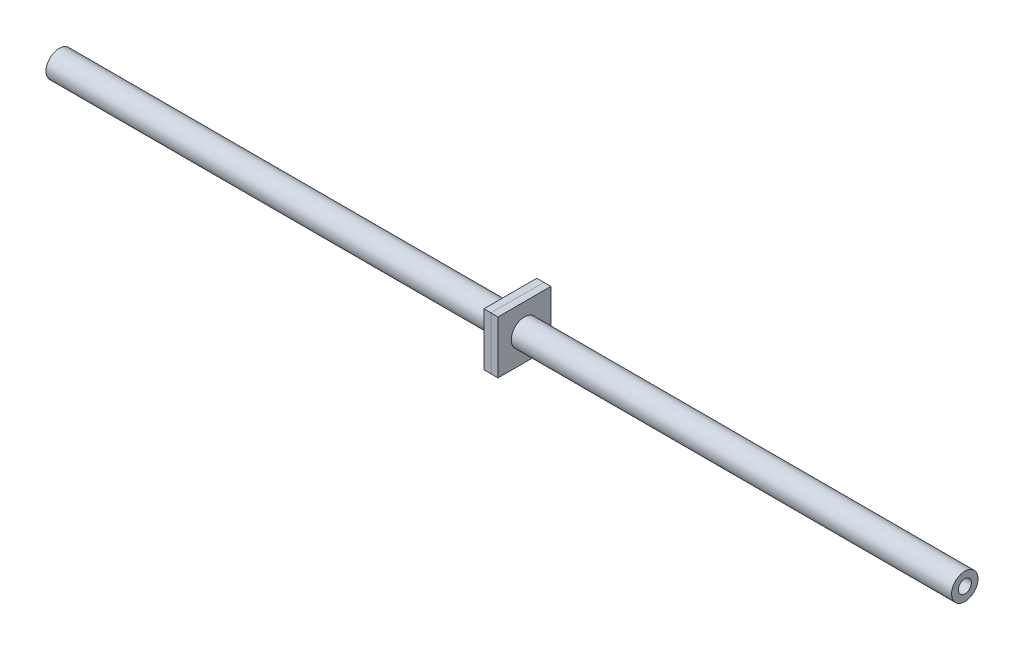
ISO-10303-21;
HEADER;
FILE_DESCRIPTION(('STEP AP214'),'2;1');
FILE_NAME('part.step','',(''),(''),'','','');
FILE_SCHEMA(('AUTOMOTIVE_DESIGN { 1 0 10303 214 1 1 1 1 }'));
ENDSEC;
DATA;
#1=APPLICATION_CONTEXT('core data for automotive mechanical design processes');
#2=APPLICATION_PROTOCOL_DEFINITION('international standard','automotive_design',2000,#1);
#3=PRODUCT_CONTEXT('',#1,'mechanical');
#4=PRODUCT('Part','Part','',(#3));
#5=PRODUCT_RELATED_PRODUCT_CATEGORY('part','',(#4));
#6=PRODUCT_DEFINITION_FORMATION('','',#4);
#7=PRODUCT_DEFINITION_CONTEXT('part definition',#1,'design');
#8=PRODUCT_DEFINITION('design','',#6,#7);
#9=PRODUCT_DEFINITION_SHAPE('','',#8);
#10=(LENGTH_UNIT() NAMED_UNIT(*) SI_UNIT(.MILLI.,.METRE.));
#11=(NAMED_UNIT(*) PLANE_ANGLE_UNIT() SI_UNIT($,.RADIAN.));
#12=(NAMED_UNIT(*) SI_UNIT($,.STERADIAN.) SOLID_ANGLE_UNIT());
#13=UNCERTAINTY_MEASURE_WITH_UNIT(LENGTH_MEASURE(1.E-05),#10,'distance_accuracy_value','');
#14=(GEOMETRIC_REPRESENTATION_CONTEXT(3) GLOBAL_UNCERTAINTY_ASSIGNED_CONTEXT((#13)) GLOBAL_UNIT_ASSIGNED_CONTEXT((#10,
#11,#12)) REPRESENTATION_CONTEXT('',''));
#15=CARTESIAN_POINT('',(0.,0.,0.));
#16=DIRECTION('',(0.,0.,1.));
#17=DIRECTION('',(1.,0.,0.));
#18=AXIS2_PLACEMENT_3D('',#15,#16,#17);
#19=CARTESIAN_POINT('',(162.56,0.,0.));
#20=DIRECTION('',(1.,0.,0.));
#21=DIRECTION('',(0.,0.,-1.));
#22=AXIS2_PLACEMENT_3D('',#19,#20,#21);
#23=PLANE('',#22);
#24=DIRECTION('',(0.,1.,0.));
#25=VECTOR('',#24,1.);
#26=CARTESIAN_POINT('',(162.56,0.,-9.525));
#27=LINE('',#26,#25);
#28=CARTESIAN_POINT('',(162.56,-9.525,-9.525));
#29=VERTEX_POINT('',#28);
#30=CARTESIAN_POINT('',(162.56,9.525,-9.525));
#31=VERTEX_POINT('',#30);
#32=EDGE_CURVE('E113',#29,#31,#27,.T.);
#33=ORIENTED_EDGE('',*,*,#32,.F.);
#34=DIRECTION('',(0.,0.,-1.));
#35=VECTOR('',#34,1.);
#36=CARTESIAN_POINT('',(162.56,-9.525,0.));
#37=LINE('',#36,#35);
#38=CARTESIAN_POINT('',(162.56,-9.525,9.525));
#39=VERTEX_POINT('',#38);
#40=EDGE_CURVE('E110',#39,#29,#37,.T.);
#41=ORIENTED_EDGE('',*,*,#40,.F.);
#42=DIRECTION('',(0.,-1.,0.));
#43=VECTOR('',#42,1.);
#44=CARTESIAN_POINT('',(162.56,0.,9.525));
#45=LINE('',#44,#43);
#46=CARTESIAN_POINT('',(162.56,9.525,9.525));
#47=VERTEX_POINT('',#46);
#48=EDGE_CURVE('E103',#47,#39,#45,.T.);
#49=ORIENTED_EDGE('',*,*,#48,.F.);
#50=DIRECTION('',(0.,0.,1.));
#51=VECTOR('',#50,1.);
#52=CARTESIAN_POINT('',(162.56,9.525,0.));
#53=LINE('',#52,#51);
#54=EDGE_CURVE('E109',#31,#47,#53,.T.);
#55=ORIENTED_EDGE('',*,*,#54,.F.);
#56=EDGE_LOOP('',(#33,#41,#49,#55));
#57=FACE_BOUND('',#56,.T.);
#58=CARTESIAN_POINT('',(162.56,0.,0.));
#59=DIRECTION('',(-1.,0.,0.));
#60=DIRECTION('',(0.,0.,1.));
#61=AXIS2_PLACEMENT_3D('',#58,#59,#60);
#62=CIRCLE('',#61,4.7625);
#63=CARTESIAN_POINT('',(162.56,0.,4.7625));
#64=VERTEX_POINT('',#63);
#65=EDGE_CURVE('E124',#64,#64,#62,.T.);
#66=ORIENTED_EDGE('',*,*,#65,.F.);
#67=EDGE_LOOP('',(#66));
#68=FACE_BOUND('',#67,.T.);
#69=ADVANCED_FACE('F54',(#57,#68),#23,.F.);
#70=CARTESIAN_POINT('',(165.1,0.,0.));
#71=DIRECTION('',(1.,0.,0.));
#72=DIRECTION('',(0.,0.,-1.));
#73=AXIS2_PLACEMENT_3D('',#70,#71,#72);
#74=PLANE('',#73);
#75=DIRECTION('',(0.,1.,0.));
#76=VECTOR('',#75,1.);
#77=CARTESIAN_POINT('',(165.1,0.,-9.525));
#78=LINE('',#77,#76);
#79=CARTESIAN_POINT('',(165.1,-9.525,-9.525));
#80=VERTEX_POINT('',#79);
#81=CARTESIAN_POINT('',(165.1,9.525,-9.525));
#82=VERTEX_POINT('',#81);
#83=EDGE_CURVE('E120',#80,#82,#78,.T.);
#84=ORIENTED_EDGE('',*,*,#83,.T.);
#85=DIRECTION('',(0.,0.,1.));
#86=VECTOR('',#85,1.);
#87=CARTESIAN_POINT('',(165.1,9.525,0.));
#88=LINE('',#87,#86);
#89=CARTESIAN_POINT('',(165.1,9.525,9.525));
#90=VERTEX_POINT('',#89);
#91=EDGE_CURVE('E123',#82,#90,#88,.T.);
#92=ORIENTED_EDGE('',*,*,#91,.T.);
#93=DIRECTION('',(0.,-1.,0.));
#94=VECTOR('',#93,1.);
#95=CARTESIAN_POINT('',(165.1,0.,9.525));
#96=LINE('',#95,#94);
#97=CARTESIAN_POINT('',(165.1,-9.525,9.525));
#98=VERTEX_POINT('',#97);
#99=EDGE_CURVE('E105',#90,#98,#96,.T.);
#100=ORIENTED_EDGE('',*,*,#99,.T.);
#101=DIRECTION('',(0.,0.,-1.));
#102=VECTOR('',#101,1.);
#103=CARTESIAN_POINT('',(165.1,-9.525,0.));
#104=LINE('',#103,#102);
#105=EDGE_CURVE('E115',#98,#80,#104,.T.);
#106=ORIENTED_EDGE('',*,*,#105,.T.);
#107=EDGE_LOOP('',(#84,#92,#100,#106));
#108=FACE_BOUND('',#107,.T.);
#109=CARTESIAN_POINT('',(165.1,0.,0.));
#110=DIRECTION('',(-1.,0.,0.));
#111=DIRECTION('',(0.,0.,1.));
#112=AXIS2_PLACEMENT_3D('',#109,#110,#111);
#113=CIRCLE('',#112,4.7625);
#114=CARTESIAN_POINT('',(165.1,0.,4.7625));
#115=VERTEX_POINT('',#114);
#116=EDGE_CURVE('E158',#115,#115,#113,.T.);
#117=ORIENTED_EDGE('',*,*,#116,.T.);
#118=EDGE_LOOP('',(#117));
#119=FACE_BOUND('',#118,.T.);
#120=ADVANCED_FACE('F130',(#108,#119),#74,.T.);
#121=CARTESIAN_POINT('',(162.56,0.,-9.525));
#122=DIRECTION('',(0.,0.,-1.));
#123=DIRECTION('',(0.,1.,0.));
#124=AXIS2_PLACEMENT_3D('',#121,#122,#123);
#125=PLANE('',#124);
#126=ORIENTED_EDGE('',*,*,#83,.F.);
#127=DIRECTION('',(1.,0.,0.));
#128=VECTOR('',#127,1.);
#129=CARTESIAN_POINT('',(162.56,-9.525,-9.525));
#130=LINE('',#129,#128);
#131=EDGE_CURVE('E13',#29,#80,#130,.T.);
#132=ORIENTED_EDGE('',*,*,#131,.F.);
#133=ORIENTED_EDGE('',*,*,#32,.T.);
#134=DIRECTION('',(1.,0.,0.));
#135=VECTOR('',#134,1.);
#136=CARTESIAN_POINT('',(162.56,9.525,-9.525));
#137=LINE('',#136,#135);
#138=EDGE_CURVE('E58',#31,#82,#137,.T.);
#139=ORIENTED_EDGE('',*,*,#138,.T.);
#140=EDGE_LOOP('',(#126,#132,#133,#139));
#141=FACE_BOUND('',#140,.T.);
#142=ADVANCED_FACE('F56',(#141),#125,.T.);
#143=CARTESIAN_POINT('',(162.56,-9.525,0.));
#144=DIRECTION('',(0.,-1.,0.));
#145=DIRECTION('',(0.,0.,-1.));
#146=AXIS2_PLACEMENT_3D('',#143,#144,#145);
#147=PLANE('',#146);
#148=ORIENTED_EDGE('',*,*,#105,.F.);
#149=DIRECTION('',(1.,0.,0.));
#150=VECTOR('',#149,1.);
#151=CARTESIAN_POINT('',(162.56,-9.525,9.525));
#152=LINE('',#151,#150);
#153=EDGE_CURVE('E64',#39,#98,#152,.T.);
#154=ORIENTED_EDGE('',*,*,#153,.F.);
#155=ORIENTED_EDGE('',*,*,#40,.T.);
#156=ORIENTED_EDGE('',*,*,#131,.T.);
#157=EDGE_LOOP('',(#148,#154,#155,#156));
#158=FACE_BOUND('',#157,.T.);
#159=ADVANCED_FACE('F132',(#158),#147,.T.);
#160=CARTESIAN_POINT('',(162.56,0.,9.525));
#161=DIRECTION('',(0.,0.,1.));
#162=DIRECTION('',(0.,-1.,0.));
#163=AXIS2_PLACEMENT_3D('',#160,#161,#162);
#164=PLANE('',#163);
#165=ORIENTED_EDGE('',*,*,#99,.F.);
#166=DIRECTION('',(1.,0.,0.));
#167=VECTOR('',#166,1.);
#168=CARTESIAN_POINT('',(162.56,9.525,9.525));
#169=LINE('',#168,#167);
#170=EDGE_CURVE('E100',#47,#90,#169,.T.);
#171=ORIENTED_EDGE('',*,*,#170,.F.);
#172=ORIENTED_EDGE('',*,*,#48,.T.);
#173=ORIENTED_EDGE('',*,*,#153,.T.);
#174=EDGE_LOOP('',(#165,#171,#172,#173));
#175=FACE_BOUND('',#174,.T.);
#176=ADVANCED_FACE('F102',(#175),#164,.T.);
#177=CARTESIAN_POINT('',(162.56,9.525,0.));
#178=DIRECTION('',(0.,1.,0.));
#179=DIRECTION('',(0.,0.,1.));
#180=AXIS2_PLACEMENT_3D('',#177,#178,#179);
#181=PLANE('',#180);
#182=ORIENTED_EDGE('',*,*,#91,.F.);
#183=ORIENTED_EDGE('',*,*,#138,.F.);
#184=ORIENTED_EDGE('',*,*,#54,.T.);
#185=ORIENTED_EDGE('',*,*,#170,.T.);
#186=EDGE_LOOP('',(#182,#183,#184,#185));
#187=FACE_BOUND('',#186,.T.);
#188=ADVANCED_FACE('F112',(#187),#181,.T.);
#189=CARTESIAN_POINT('',(162.56,0.,0.));
#190=DIRECTION('',(1.,0.,0.));
#191=DIRECTION('',(0.,0.,-1.));
#192=AXIS2_PLACEMENT_3D('',#189,#190,#191);
#193=CYLINDRICAL_SURFACE('',#192,4.7625);
#194=ORIENTED_EDGE('',*,*,#65,.T.);
#195=EDGE_LOOP('',(#194));
#196=FACE_BOUND('',#195,.T.);
#197=ORIENTED_EDGE('',*,*,#116,.F.);
#198=EDGE_LOOP('',(#197));
#199=FACE_BOUND('',#198,.T.);
#200=ADVANCED_FACE('F147',(#196,#199),#193,.F.);
#201=CLOSED_SHELL('',(#69,#120,#142,#159,#176,#188,#200));
#202=MANIFOLD_SOLID_BREP('B2',#201);
#203=CARTESIAN_POINT('',(167.64,0.,0.));
#204=DIRECTION('',(-1.,0.,0.));
#205=DIRECTION('',(0.,0.,1.));
#206=AXIS2_PLACEMENT_3D('',#203,#204,#205);
#207=PLANE('',#206);
#208=DIRECTION('',(0.,-1.,0.));
#209=VECTOR('',#208,1.);
#210=CARTESIAN_POINT('',(167.64,9.525,9.52500000000001));
#211=LINE('',#210,#209);
#212=CARTESIAN_POINT('',(167.64,9.525,9.52500000000001));
#213=VERTEX_POINT('',#212);
#214=CARTESIAN_POINT('',(167.64,-9.525,9.525));
#215=VERTEX_POINT('',#214);
#216=EDGE_CURVE('E257',#213,#215,#211,.T.);
#217=ORIENTED_EDGE('',*,*,#216,.T.);
#218=DIRECTION('',(0.,0.,-1.));
#219=VECTOR('',#218,1.);
#220=CARTESIAN_POINT('',(167.64,-9.525,-9.525));
#221=LINE('',#220,#219);
#222=CARTESIAN_POINT('',(167.64,-9.525,-9.525));
#223=VERTEX_POINT('',#222);
#224=EDGE_CURVE('E252',#215,#223,#221,.T.);
#225=ORIENTED_EDGE('',*,*,#224,.T.);
#226=DIRECTION('',(0.,1.,0.));
#227=VECTOR('',#226,1.);
#228=CARTESIAN_POINT('',(167.64,9.525,-9.525));
#229=LINE('',#228,#227);
#230=CARTESIAN_POINT('',(167.64,9.525,-9.525));
#231=VERTEX_POINT('',#230);
#232=EDGE_CURVE('E255',#223,#231,#229,.T.);
#233=ORIENTED_EDGE('',*,*,#232,.T.);
#234=DIRECTION('',(0.,0.,1.));
#235=VECTOR('',#234,1.);
#236=CARTESIAN_POINT('',(167.64,9.525,-9.525));
#237=LINE('',#236,#235);
#238=EDGE_CURVE('E222',#231,#213,#237,.T.);
#239=ORIENTED_EDGE('',*,*,#238,.T.);
#240=EDGE_LOOP('',(#217,#225,#233,#239));
#241=FACE_BOUND('',#240,.T.);
#242=CARTESIAN_POINT('',(167.64,0.,0.));
#243=DIRECTION('',(1.,0.,0.));
#244=DIRECTION('',(0.,0.,-1.));
#245=AXIS2_PLACEMENT_3D('',#242,#243,#244);
#246=CIRCLE('',#245,4.7625);
#247=CARTESIAN_POINT('',(167.64,0.,-4.7625));
#248=VERTEX_POINT('',#247);
#249=EDGE_CURVE('E272',#248,#248,#246,.T.);
#250=ORIENTED_EDGE('',*,*,#249,.F.);
#251=EDGE_LOOP('',(#250));
#252=FACE_BOUND('',#251,.T.);
#253=ADVANCED_FACE('F205',(#241,#252),#207,.F.);
#254=CARTESIAN_POINT('',(165.1,0.,0.));
#255=DIRECTION('',(-1.,0.,0.));
#256=DIRECTION('',(0.,0.,1.));
#257=AXIS2_PLACEMENT_3D('',#254,#255,#256);
#258=PLANE('',#257);
#259=DIRECTION('',(0.,-1.,0.));
#260=VECTOR('',#259,1.);
#261=CARTESIAN_POINT('',(165.1,9.525,9.52500000000001));
#262=LINE('',#261,#260);
#263=CARTESIAN_POINT('',(165.1,9.525,9.52500000000001));
#264=VERTEX_POINT('',#263);
#265=CARTESIAN_POINT('',(165.1,-9.525,9.525));
#266=VERTEX_POINT('',#265);
#267=EDGE_CURVE('E269',#264,#266,#262,.T.);
#268=ORIENTED_EDGE('',*,*,#267,.F.);
#269=DIRECTION('',(0.,0.,1.));
#270=VECTOR('',#269,1.);
#271=CARTESIAN_POINT('',(165.1,9.525,-9.525));
#272=LINE('',#271,#270);
#273=CARTESIAN_POINT('',(165.1,9.525,-9.525));
#274=VERTEX_POINT('',#273);
#275=EDGE_CURVE('E245',#274,#264,#272,.T.);
#276=ORIENTED_EDGE('',*,*,#275,.F.);
#277=DIRECTION('',(0.,1.,0.));
#278=VECTOR('',#277,1.);
#279=CARTESIAN_POINT('',(165.1,9.525,-9.525));
#280=LINE('',#279,#278);
#281=CARTESIAN_POINT('',(165.1,-9.525,-9.525));
#282=VERTEX_POINT('',#281);
#283=EDGE_CURVE('E239',#282,#274,#280,.T.);
#284=ORIENTED_EDGE('',*,*,#283,.F.);
#285=DIRECTION('',(0.,0.,-1.));
#286=VECTOR('',#285,1.);
#287=CARTESIAN_POINT('',(165.1,-9.525,-9.525));
#288=LINE('',#287,#286);
#289=EDGE_CURVE('E261',#266,#282,#288,.T.);
#290=ORIENTED_EDGE('',*,*,#289,.F.);
#291=EDGE_LOOP('',(#268,#276,#284,#290));
#292=FACE_BOUND('',#291,.T.);
#293=CARTESIAN_POINT('',(165.1,0.,0.));
#294=DIRECTION('',(1.,0.,0.));
#295=DIRECTION('',(0.,0.,-1.));
#296=AXIS2_PLACEMENT_3D('',#293,#294,#295);
#297=CIRCLE('',#296,4.7625);
#298=CARTESIAN_POINT('',(165.1,0.,-4.7625));
#299=VERTEX_POINT('',#298);
#300=EDGE_CURVE('E284',#299,#299,#297,.T.);
#301=ORIENTED_EDGE('',*,*,#300,.T.);
#302=EDGE_LOOP('',(#301));
#303=FACE_BOUND('',#302,.T.);
#304=ADVANCED_FACE('F280',(#292,#303),#258,.T.);
#305=CARTESIAN_POINT('',(167.64,9.525,9.52500000000001));
#306=DIRECTION('',(0.,0.,-1.));
#307=DIRECTION('',(0.,1.,0.));
#308=AXIS2_PLACEMENT_3D('',#305,#306,#307);
#309=PLANE('',#308);
#310=ORIENTED_EDGE('',*,*,#267,.T.);
#311=DIRECTION('',(-1.,0.,0.));
#312=VECTOR('',#311,1.);
#313=CARTESIAN_POINT('',(167.64,-9.525,9.525));
#314=LINE('',#313,#312);
#315=EDGE_CURVE('E52',#215,#266,#314,.T.);
#316=ORIENTED_EDGE('',*,*,#315,.F.);
#317=ORIENTED_EDGE('',*,*,#216,.F.);
#318=DIRECTION('',(-1.,0.,0.));
#319=VECTOR('',#318,1.);
#320=CARTESIAN_POINT('',(167.64,9.525,9.52500000000001));
#321=LINE('',#320,#319);
#322=EDGE_CURVE('E265',#213,#264,#321,.T.);
#323=ORIENTED_EDGE('',*,*,#322,.T.);
#324=EDGE_LOOP('',(#310,#316,#317,#323));
#325=FACE_BOUND('',#324,.T.);
#326=ADVANCED_FACE('F207',(#325),#309,.F.);
#327=CARTESIAN_POINT('',(167.64,-9.525,-9.525));
#328=DIRECTION('',(0.,1.,0.));
#329=DIRECTION('',(0.,0.,1.));
#330=AXIS2_PLACEMENT_3D('',#327,#328,#329);
#331=PLANE('',#330);
#332=ORIENTED_EDGE('',*,*,#289,.T.);
#333=DIRECTION('',(-1.,0.,0.));
#334=VECTOR('',#333,1.);
#335=CARTESIAN_POINT('',(167.64,-9.525,-9.525));
#336=LINE('',#335,#334);
#337=EDGE_CURVE('E214',#223,#282,#336,.T.);
#338=ORIENTED_EDGE('',*,*,#337,.F.);
#339=ORIENTED_EDGE('',*,*,#224,.F.);
#340=ORIENTED_EDGE('',*,*,#315,.T.);
#341=EDGE_LOOP('',(#332,#338,#339,#340));
#342=FACE_BOUND('',#341,.T.);
#343=ADVANCED_FACE('F260',(#342),#331,.F.);
#344=CARTESIAN_POINT('',(167.64,9.525,-9.525));
#345=DIRECTION('',(0.,0.,1.));
#346=DIRECTION('',(0.,-1.,0.));
#347=AXIS2_PLACEMENT_3D('',#344,#345,#346);
#348=PLANE('',#347);
#349=ORIENTED_EDGE('',*,*,#283,.T.);
#350=DIRECTION('',(-1.,0.,0.));
#351=VECTOR('',#350,1.);
#352=CARTESIAN_POINT('',(167.64,9.525,-9.525));
#353=LINE('',#352,#351);
#354=EDGE_CURVE('E262',#231,#274,#353,.T.);
#355=ORIENTED_EDGE('',*,*,#354,.F.);
#356=ORIENTED_EDGE('',*,*,#232,.F.);
#357=ORIENTED_EDGE('',*,*,#337,.T.);
#358=EDGE_LOOP('',(#349,#355,#356,#357));
#359=FACE_BOUND('',#358,.T.);
#360=ADVANCED_FACE('F263',(#359),#348,.F.);
#361=CARTESIAN_POINT('',(167.64,9.525,-9.525));
#362=DIRECTION('',(0.,-1.,0.));
#363=DIRECTION('',(0.,0.,-1.));
#364=AXIS2_PLACEMENT_3D('',#361,#362,#363);
#365=PLANE('',#364);
#366=ORIENTED_EDGE('',*,*,#275,.T.);
#367=ORIENTED_EDGE('',*,*,#322,.F.);
#368=ORIENTED_EDGE('',*,*,#238,.F.);
#369=ORIENTED_EDGE('',*,*,#354,.T.);
#370=EDGE_LOOP('',(#366,#367,#368,#369));
#371=FACE_BOUND('',#370,.T.);
#372=ADVANCED_FACE('F277',(#371),#365,.F.);
#373=CARTESIAN_POINT('',(167.64,0.,0.));
#374=DIRECTION('',(-1.,0.,0.));
#375=DIRECTION('',(0.,0.,1.));
#376=AXIS2_PLACEMENT_3D('',#373,#374,#375);
#377=CYLINDRICAL_SURFACE('',#376,4.7625);
#378=ORIENTED_EDGE('',*,*,#249,.T.);
#379=EDGE_LOOP('',(#378));
#380=FACE_BOUND('',#379,.T.);
#381=ORIENTED_EDGE('',*,*,#300,.F.);
#382=EDGE_LOOP('',(#381));
#383=FACE_BOUND('',#382,.T.);
#384=ADVANCED_FACE('F290',(#380,#383),#377,.F.);
#385=CLOSED_SHELL('',(#253,#304,#326,#343,#360,#372,#384));
#386=MANIFOLD_SOLID_BREP('B7',#385);
#387=CARTESIAN_POINT('',(326.310830854,0.,0.));
#388=DIRECTION('',(-1.,0.,0.));
#389=DIRECTION('',(0.,0.,1.));
#390=AXIS2_PLACEMENT_3D('',#387,#388,#389);
#391=CYLINDRICAL_SURFACE('',#390,2.3495);
#392=CARTESIAN_POINT('',(326.310830854,0.,0.));
#393=DIRECTION('',(1.,0.,0.));
#394=DIRECTION('',(0.,0.,-1.));
#395=AXIS2_PLACEMENT_3D('',#392,#393,#394);
#396=CIRCLE('',#395,2.3495);
#397=CARTESIAN_POINT('',(326.310830854,0.,2.3495));
#398=VERTEX_POINT('',#397);
#399=EDGE_CURVE('E356',#398,#398,#396,.T.);
#400=CARTESIAN_POINT('',(0.,0.,0.));
#401=DIRECTION('',(1.,0.,0.));
#402=DIRECTION('',(0.,0.,-1.));
#403=AXIS2_PLACEMENT_3D('',#400,#401,#402);
#404=CIRCLE('',#403,2.3495);
#405=CARTESIAN_POINT('',(0.,0.,2.3495));
#406=VERTEX_POINT('',#405);
#407=EDGE_CURVE('E362',#406,#406,#404,.T.);
#408=CARTESIAN_POINT('',(326.310830854,0.,2.3495));
#409=CARTESIAN_POINT('',(322.911759699271,0.,2.3495));
#410=CARTESIAN_POINT('',(319.512688544542,0.,2.3495));
#411=CARTESIAN_POINT('',(312.714546235083,0.,2.3495));
#412=CARTESIAN_POINT('',(309.315475080354,0.,2.3495));
#413=CARTESIAN_POINT('',(302.517332770896,0.,2.3495));
#414=CARTESIAN_POINT('',(299.118261616167,0.,2.3495));
#415=CARTESIAN_POINT('',(292.320119306708,0.,2.3495));
#416=CARTESIAN_POINT('',(288.921048151979,0.,2.3495));
#417=CARTESIAN_POINT('',(282.122905842521,0.,2.3495));
#418=CARTESIAN_POINT('',(278.723834687792,0.,2.3495));
#419=CARTESIAN_POINT('',(271.925692378333,0.,2.3495));
#420=CARTESIAN_POINT('',(268.526621223604,0.,2.3495));
#421=CARTESIAN_POINT('',(261.728478914146,0.,2.3495));
#422=CARTESIAN_POINT('',(258.329407759417,0.,2.3495));
#423=CARTESIAN_POINT('',(251.531265449958,0.,2.3495));
#424=CARTESIAN_POINT('',(248.132194295229,0.,2.3495));
#425=CARTESIAN_POINT('',(241.334051985771,0.,2.3495));
#426=CARTESIAN_POINT('',(237.934980831042,0.,2.3495));
#427=CARTESIAN_POINT('',(231.136838521583,0.,2.3495));
#428=CARTESIAN_POINT('',(227.737767366854,0.,2.3495));
#429=CARTESIAN_POINT('',(220.939625057396,0.,2.3495));
#430=CARTESIAN_POINT('',(217.540553902667,0.,2.3495));
#431=CARTESIAN_POINT('',(210.742411593208,0.,2.3495));
#432=CARTESIAN_POINT('',(207.343340438479,0.,2.3495));
#433=CARTESIAN_POINT('',(200.545198129021,0.,2.3495));
#434=CARTESIAN_POINT('',(197.146126974292,0.,2.3495));
#435=CARTESIAN_POINT('',(190.347984664833,0.,2.3495));
#436=CARTESIAN_POINT('',(186.948913510104,0.,2.3495));
#437=CARTESIAN_POINT('',(180.150771200646,0.,2.3495));
#438=CARTESIAN_POINT('',(176.751700045917,0.,2.3495));
#439=CARTESIAN_POINT('',(169.953557736458,0.,2.3495));
#440=CARTESIAN_POINT('',(166.554486581729,0.,2.3495));
#441=CARTESIAN_POINT('',(159.756344272271,0.,2.3495));
#442=CARTESIAN_POINT('',(156.357273117542,0.,2.3495));
#443=CARTESIAN_POINT('',(149.559130808083,0.,2.3495));
#444=CARTESIAN_POINT('',(146.160059653354,0.,2.3495));
#445=CARTESIAN_POINT('',(139.361917343896,0.,2.3495));
#446=CARTESIAN_POINT('',(135.962846189167,0.,2.3495));
#447=CARTESIAN_POINT('',(129.164703879708,0.,2.3495));
#448=CARTESIAN_POINT('',(125.765632724979,0.,2.3495));
#449=CARTESIAN_POINT('',(118.967490415521,0.,2.3495));
#450=CARTESIAN_POINT('',(115.568419260792,0.,2.3495));
#451=CARTESIAN_POINT('',(108.770276951333,0.,2.3495));
#452=CARTESIAN_POINT('',(105.371205796604,0.,2.3495));
#453=CARTESIAN_POINT('',(98.5730634871458,0.,2.3495));
#454=CARTESIAN_POINT('',(95.1739923324166,0.,2.3495));
#455=CARTESIAN_POINT('',(88.3758500229583,0.,2.3495));
#456=CARTESIAN_POINT('',(84.9767788682291,0.,2.3495));
#457=CARTESIAN_POINT('',(78.1786365587708,0.,2.3495));
#458=CARTESIAN_POINT('',(74.7795654040416,0.,2.3495));
#459=CARTESIAN_POINT('',(67.9814230945833,0.,2.3495));
#460=CARTESIAN_POINT('',(64.5823519398541,0.,2.3495));
#461=CARTESIAN_POINT('',(57.7842096303958,0.,2.3495));
#462=CARTESIAN_POINT('',(54.3851384756667,0.,2.3495));
#463=CARTESIAN_POINT('',(47.5869961662084,0.,2.3495));
#464=CARTESIAN_POINT('',(44.1879250114792,0.,2.3495));
#465=CARTESIAN_POINT('',(37.3897827020208,0.,2.3495));
#466=CARTESIAN_POINT('',(33.9907115472917,0.,2.3495));
#467=CARTESIAN_POINT('',(27.1925692378333,0.,2.3495));
#468=CARTESIAN_POINT('',(23.7934980831042,0.,2.3495));
#469=CARTESIAN_POINT('',(16.9953557736458,0.,2.3495));
#470=CARTESIAN_POINT('',(13.5962846189167,0.,2.3495));
#471=CARTESIAN_POINT('',(6.79814230945833,0.,2.3495));
#472=CARTESIAN_POINT('',(3.39907115472917,0.,2.3495));
#473=CARTESIAN_POINT('',(0.,0.,2.3495));
#474=B_SPLINE_CURVE_WITH_KNOTS('',3,(#408,#409,#410,#411,#412,#413,#414,#415,#416,#417,#418,
#419,#420,#421,#422,#423,#424,#425,#426,#427,#428,#429,#430,#431,#432,#433,#434,#435,#436,#437,
#438,#439,#440,#441,#442,#443,#444,#445,#446,#447,#448,#449,#450,#451,#452,#453,#454,#455,#456,
#457,#458,#459,#460,#461,#462,#463,#464,#465,#466,#467,#468,#469,#470,#471,#472,#473),
.UNSPECIFIED.,.F.,.F.,(4,2,2,2,2,2,2,2,2,2,2,2,2,2,2,2,2,2,2,2,2,2,2,2,2,2,2,2,2,2,2,2,4),(0.,
10.1972134641874,20.394426928375,30.5916403925625,40.78885385675,50.9860673209375,
61.183280785125,71.3804942493125,81.5777077134999,91.7749211776875,101.972134641875,
112.169348106062,122.36656157025,132.563775034437,142.760988498625,152.958201962812,
163.155415427,173.352628891187,183.549842355375,193.747055819562,203.94426928375,
214.141482747937,224.338696212125,234.535909676312,244.7331231405,254.930336604687,
265.127550068875,275.324763533062,285.52197699725,295.719190461437,305.916403925625,
316.113617389812,326.310830854),.UNSPECIFIED.);
#475=EDGE_CURVE('BSEAM349',#398,#406,#474,.T.);
#476=ORIENTED_EDGE('',*,*,#399,.T.);
#477=ORIENTED_EDGE('',*,*,#407,.F.);
#478=ORIENTED_EDGE('',*,*,#475,.T.);
#479=ORIENTED_EDGE('',*,*,#475,.F.);
#480=EDGE_LOOP('',(#476,#478,#477,#479));
#481=FACE_BOUND('',#480,.T.);
#482=ADVANCED_FACE('F349',(#481),#391,.F.);
#483=CARTESIAN_POINT('',(326.310830854,0.,0.));
#484=DIRECTION('',(-1.,0.,0.));
#485=DIRECTION('',(0.,0.,1.));
#486=AXIS2_PLACEMENT_3D('',#483,#484,#485);
#487=CYLINDRICAL_SURFACE('',#486,4.7625);
#488=CARTESIAN_POINT('',(326.310830854,0.,0.));
#489=DIRECTION('',(1.,0.,0.));
#490=DIRECTION('',(0.,0.,-1.));
#491=AXIS2_PLACEMENT_3D('',#488,#489,#490);
#492=CIRCLE('',#491,4.7625);
#493=CARTESIAN_POINT('',(326.310830854,0.,4.7625));
#494=VERTEX_POINT('',#493);
#495=EDGE_CURVE('E204',#494,#494,#492,.T.);
#496=CARTESIAN_POINT('',(0.,0.,0.));
#497=DIRECTION('',(1.,0.,0.));
#498=DIRECTION('',(0.,0.,-1.));
#499=AXIS2_PLACEMENT_3D('',#496,#497,#498);
#500=CIRCLE('',#499,4.7625);
#501=CARTESIAN_POINT('',(0.,0.,4.7625));
#502=VERTEX_POINT('',#501);
#503=EDGE_CURVE('E352',#502,#502,#500,.T.);
#504=CARTESIAN_POINT('',(326.310830854,0.,4.7625));
#505=CARTESIAN_POINT('',(322.911759699271,0.,4.7625));
#506=CARTESIAN_POINT('',(319.512688544542,0.,4.7625));
#507=CARTESIAN_POINT('',(312.714546235083,0.,4.7625));
#508=CARTESIAN_POINT('',(309.315475080354,0.,4.7625));
#509=CARTESIAN_POINT('',(302.517332770896,0.,4.7625));
#510=CARTESIAN_POINT('',(299.118261616167,0.,4.7625));
#511=CARTESIAN_POINT('',(292.320119306708,0.,4.7625));
#512=CARTESIAN_POINT('',(288.921048151979,0.,4.7625));
#513=CARTESIAN_POINT('',(282.122905842521,0.,4.7625));
#514=CARTESIAN_POINT('',(278.723834687792,0.,4.7625));
#515=CARTESIAN_POINT('',(271.925692378333,0.,4.7625));
#516=CARTESIAN_POINT('',(268.526621223604,0.,4.7625));
#517=CARTESIAN_POINT('',(261.728478914146,0.,4.7625));
#518=CARTESIAN_POINT('',(258.329407759417,0.,4.7625));
#519=CARTESIAN_POINT('',(251.531265449958,0.,4.7625));
#520=CARTESIAN_POINT('',(248.132194295229,0.,4.7625));
#521=CARTESIAN_POINT('',(241.334051985771,0.,4.7625));
#522=CARTESIAN_POINT('',(237.934980831042,0.,4.7625));
#523=CARTESIAN_POINT('',(231.136838521583,0.,4.7625));
#524=CARTESIAN_POINT('',(227.737767366854,0.,4.7625));
#525=CARTESIAN_POINT('',(220.939625057396,0.,4.7625));
#526=CARTESIAN_POINT('',(217.540553902667,0.,4.7625));
#527=CARTESIAN_POINT('',(210.742411593208,0.,4.7625));
#528=CARTESIAN_POINT('',(207.343340438479,0.,4.7625));
#529=CARTESIAN_POINT('',(200.545198129021,0.,4.7625));
#530=CARTESIAN_POINT('',(197.146126974292,0.,4.7625));
#531=CARTESIAN_POINT('',(190.347984664833,0.,4.7625));
#532=CARTESIAN_POINT('',(186.948913510104,0.,4.7625));
#533=CARTESIAN_POINT('',(180.150771200646,0.,4.7625));
#534=CARTESIAN_POINT('',(176.751700045917,0.,4.7625));
#535=CARTESIAN_POINT('',(169.953557736458,0.,4.7625));
#536=CARTESIAN_POINT('',(166.554486581729,0.,4.7625));
#537=CARTESIAN_POINT('',(159.756344272271,0.,4.7625));
#538=CARTESIAN_POINT('',(156.357273117542,0.,4.7625));
#539=CARTESIAN_POINT('',(149.559130808083,0.,4.7625));
#540=CARTESIAN_POINT('',(146.160059653354,0.,4.7625));
#541=CARTESIAN_POINT('',(139.361917343896,0.,4.7625));
#542=CARTESIAN_POINT('',(135.962846189167,0.,4.7625));
#543=CARTESIAN_POINT('',(129.164703879708,0.,4.7625));
#544=CARTESIAN_POINT('',(125.765632724979,0.,4.7625));
#545=CARTESIAN_POINT('',(118.967490415521,0.,4.7625));
#546=CARTESIAN_POINT('',(115.568419260792,0.,4.7625));
#547=CARTESIAN_POINT('',(108.770276951333,0.,4.7625));
#548=CARTESIAN_POINT('',(105.371205796604,0.,4.7625));
#549=CARTESIAN_POINT('',(98.5730634871458,0.,4.7625));
#550=CARTESIAN_POINT('',(95.1739923324166,0.,4.7625));
#551=CARTESIAN_POINT('',(88.3758500229583,0.,4.7625));
#552=CARTESIAN_POINT('',(84.9767788682291,0.,4.7625));
#553=CARTESIAN_POINT('',(78.1786365587708,0.,4.7625));
#554=CARTESIAN_POINT('',(74.7795654040417,0.,4.7625));
#555=CARTESIAN_POINT('',(67.9814230945834,0.,4.7625));
#556=CARTESIAN_POINT('',(64.5823519398542,0.,4.7625));
#557=CARTESIAN_POINT('',(57.7842096303959,0.,4.7625));
#558=CARTESIAN_POINT('',(54.3851384756667,0.,4.7625));
#559=CARTESIAN_POINT('',(47.5869961662084,0.,4.7625));
#560=CARTESIAN_POINT('',(44.1879250114792,0.,4.7625));
#561=CARTESIAN_POINT('',(37.3897827020208,0.,4.7625));
#562=CARTESIAN_POINT('',(33.9907115472917,0.,4.7625));
#563=CARTESIAN_POINT('',(27.1925692378333,0.,4.7625));
#564=CARTESIAN_POINT('',(23.7934980831042,0.,4.7625));
#565=CARTESIAN_POINT('',(16.9953557736458,0.,4.7625));
#566=CARTESIAN_POINT('',(13.5962846189167,0.,4.7625));
#567=CARTESIAN_POINT('',(6.79814230945833,0.,4.7625));
#568=CARTESIAN_POINT('',(3.39907115472917,0.,4.7625));
#569=CARTESIAN_POINT('',(0.,0.,4.7625));
#570=B_SPLINE_CURVE_WITH_KNOTS('',3,(#504,#505,#506,#507,#508,#509,#510,#511,#512,#513,#514,
#515,#516,#517,#518,#519,#520,#521,#522,#523,#524,#525,#526,#527,#528,#529,#530,#531,#532,#533,
#534,#535,#536,#537,#538,#539,#540,#541,#542,#543,#544,#545,#546,#547,#548,#549,#550,#551,#552,
#553,#554,#555,#556,#557,#558,#559,#560,#561,#562,#563,#564,#565,#566,#567,#568,#569),
.UNSPECIFIED.,.F.,.F.,(4,2,2,2,2,2,2,2,2,2,2,2,2,2,2,2,2,2,2,2,2,2,2,2,2,2,2,2,2,2,2,2,4),(0.,
10.1972134641875,20.394426928375,30.5916403925625,40.78885385675,50.9860673209375,
61.183280785125,71.3804942493125,81.5777077135,91.7749211776875,101.972134641875,
112.169348106063,122.36656157025,132.563775034437,142.760988498625,152.958201962813,
163.155415427,173.352628891188,183.549842355375,193.747055819563,203.94426928375,
214.141482747938,224.338696212125,234.535909676313,244.7331231405,254.930336604687,
265.127550068875,275.324763533062,285.52197699725,295.719190461437,305.916403925625,
316.113617389812,326.310830854),.UNSPECIFIED.);
#571=EDGE_CURVE('BSEAM369',#494,#502,#570,.T.);
#572=ORIENTED_EDGE('',*,*,#495,.F.);
#573=ORIENTED_EDGE('',*,*,#503,.T.);
#574=ORIENTED_EDGE('',*,*,#571,.T.);
#575=ORIENTED_EDGE('',*,*,#571,.F.);
#576=EDGE_LOOP('',(#572,#574,#573,#575));
#577=FACE_BOUND('',#576,.T.);
#578=ADVANCED_FACE('F369',(#577),#487,.T.);
#579=CARTESIAN_POINT('',(326.310830854,0.,0.));
#580=DIRECTION('',(1.,0.,0.));
#581=DIRECTION('',(0.,0.,-1.));
#582=AXIS2_PLACEMENT_3D('',#579,#580,#581);
#583=PLANE('',#582);
#584=ORIENTED_EDGE('',*,*,#399,.F.);
#585=EDGE_LOOP('',(#584));
#586=FACE_BOUND('',#585,.T.);
#587=ORIENTED_EDGE('',*,*,#495,.T.);
#588=EDGE_LOOP('',(#587));
#589=FACE_BOUND('',#588,.T.);
#590=ADVANCED_FACE('F373',(#586,#589),#583,.T.);
#591=CARTESIAN_POINT('',(0.,0.,0.));
#592=DIRECTION('',(1.,0.,0.));
#593=DIRECTION('',(0.,0.,-1.));
#594=AXIS2_PLACEMENT_3D('',#591,#592,#593);
#595=PLANE('',#594);
#596=ORIENTED_EDGE('',*,*,#407,.T.);
#597=EDGE_LOOP('',(#596));
#598=FACE_BOUND('',#597,.T.);
#599=ORIENTED_EDGE('',*,*,#503,.F.);
#600=EDGE_LOOP('',(#599));
#601=FACE_BOUND('',#600,.T.);
#602=ADVANCED_FACE('F371',(#598,#601),#595,.F.);
#603=CLOSED_SHELL('',(#482,#578,#590,#602));
#604=MANIFOLD_SOLID_BREP('B46',#603);
#605=ADVANCED_BREP_SHAPE_REPRESENTATION('',(#18,#202,#386,#604),#14);
#606=SHAPE_DEFINITION_REPRESENTATION(#9,#605);
ENDSEC;
END-ISO-10303-21;
